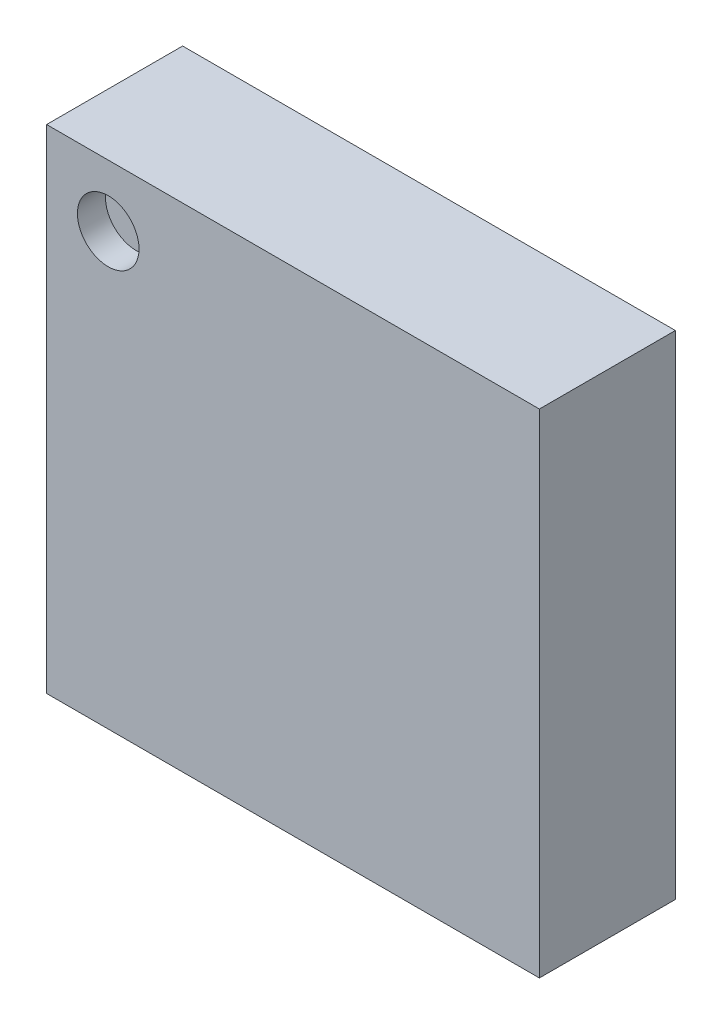
ISO-10303-21;
HEADER;
FILE_DESCRIPTION(('STEP AP214'),'2;1');
FILE_NAME('part.step','',(''),(''),'','','');
FILE_SCHEMA(('AUTOMOTIVE_DESIGN { 1 0 10303 214 1 1 1 1 }'));
ENDSEC;
DATA;
#1=APPLICATION_CONTEXT('core data for automotive mechanical design processes');
#2=APPLICATION_PROTOCOL_DEFINITION('international standard','automotive_design',2000,#1);
#3=PRODUCT_CONTEXT('',#1,'mechanical');
#4=PRODUCT('Part','Part','',(#3));
#5=PRODUCT_RELATED_PRODUCT_CATEGORY('part','',(#4));
#6=PRODUCT_DEFINITION_FORMATION('','',#4);
#7=PRODUCT_DEFINITION_CONTEXT('part definition',#1,'design');
#8=PRODUCT_DEFINITION('design','',#6,#7);
#9=PRODUCT_DEFINITION_SHAPE('','',#8);
#10=(LENGTH_UNIT() NAMED_UNIT(*) SI_UNIT(.MILLI.,.METRE.));
#11=(NAMED_UNIT(*) PLANE_ANGLE_UNIT() SI_UNIT($,.RADIAN.));
#12=(NAMED_UNIT(*) SI_UNIT($,.STERADIAN.) SOLID_ANGLE_UNIT());
#13=UNCERTAINTY_MEASURE_WITH_UNIT(LENGTH_MEASURE(1.E-05),#10,'distance_accuracy_value','');
#14=(GEOMETRIC_REPRESENTATION_CONTEXT(3) GLOBAL_UNCERTAINTY_ASSIGNED_CONTEXT((#13)) GLOBAL_UNIT_ASSIGNED_CONTEXT((#10,
#11,#12)) REPRESENTATION_CONTEXT('',''));
#15=CARTESIAN_POINT('',(0.,0.,0.));
#16=DIRECTION('',(0.,0.,1.));
#17=DIRECTION('',(1.,0.,0.));
#18=AXIS2_PLACEMENT_3D('',#15,#16,#17);
#19=CARTESIAN_POINT('',(-0.308,-0.308,0.18));
#20=DIRECTION('',(1.,0.,0.));
#21=DIRECTION('',(0.,0.,1.));
#22=AXIS2_PLACEMENT_3D('',#19,#20,#21);
#23=PLANE('',#22);
#24=DIRECTION('',(0.,1.,0.));
#25=VECTOR('',#24,1.);
#26=CARTESIAN_POINT('',(-0.308,-0.308,0.35));
#27=LINE('',#26,#25);
#28=CARTESIAN_POINT('',(-0.308,-0.308,0.35));
#29=VERTEX_POINT('',#28);
#30=CARTESIAN_POINT('',(-0.308,0.308,0.35));
#31=VERTEX_POINT('',#30);
#32=EDGE_CURVE('E11',#29,#31,#27,.T.);
#33=ORIENTED_EDGE('',*,*,#32,.T.);
#34=DIRECTION('',(0.,0.,1.));
#35=VECTOR('',#34,1.);
#36=CARTESIAN_POINT('',(-0.308,0.308,0.18));
#37=LINE('',#36,#35);
#38=CARTESIAN_POINT('',(-0.308,0.308,0.18));
#39=VERTEX_POINT('',#38);
#40=EDGE_CURVE('E24',#39,#31,#37,.T.);
#41=ORIENTED_EDGE('',*,*,#40,.F.);
#42=DIRECTION('',(0.,1.,0.));
#43=VECTOR('',#42,1.);
#44=CARTESIAN_POINT('',(-0.308,-0.308,0.18));
#45=LINE('',#44,#43);
#46=CARTESIAN_POINT('',(-0.308,-0.308,0.18));
#47=VERTEX_POINT('',#46);
#48=EDGE_CURVE('E95',#47,#39,#45,.T.);
#49=ORIENTED_EDGE('',*,*,#48,.F.);
#50=DIRECTION('',(0.,0.,1.));
#51=VECTOR('',#50,1.);
#52=CARTESIAN_POINT('',(-0.308,-0.308,0.18));
#53=LINE('',#52,#51);
#54=EDGE_CURVE('E36',#47,#29,#53,.T.);
#55=ORIENTED_EDGE('',*,*,#54,.T.);
#56=EDGE_LOOP('',(#33,#41,#49,#55));
#57=FACE_BOUND('',#56,.T.);
#58=ADVANCED_FACE('F17',(#57),#23,.F.);
#59=CARTESIAN_POINT('',(-0.308,-0.308,0.18));
#60=DIRECTION('',(0.,1.,0.));
#61=DIRECTION('',(0.,0.,1.));
#62=AXIS2_PLACEMENT_3D('',#59,#60,#61);
#63=PLANE('',#62);
#64=DIRECTION('',(0.,0.,1.));
#65=VECTOR('',#64,1.);
#66=CARTESIAN_POINT('',(0.308,-0.308,0.18));
#67=LINE('',#66,#65);
#68=CARTESIAN_POINT('',(0.308,-0.308,0.18));
#69=VERTEX_POINT('',#68);
#70=CARTESIAN_POINT('',(0.308,-0.308,0.35));
#71=VERTEX_POINT('',#70);
#72=EDGE_CURVE('E91',#69,#71,#67,.T.);
#73=ORIENTED_EDGE('',*,*,#72,.T.);
#74=DIRECTION('',(1.,0.,0.));
#75=VECTOR('',#74,1.);
#76=CARTESIAN_POINT('',(-0.308,-0.308,0.35));
#77=LINE('',#76,#75);
#78=EDGE_CURVE('E89',#29,#71,#77,.T.);
#79=ORIENTED_EDGE('',*,*,#78,.F.);
#80=ORIENTED_EDGE('',*,*,#54,.F.);
#81=DIRECTION('',(1.,0.,0.));
#82=VECTOR('',#81,1.);
#83=CARTESIAN_POINT('',(-0.308,-0.308,0.18));
#84=LINE('',#83,#82);
#85=EDGE_CURVE('E87',#47,#69,#84,.T.);
#86=ORIENTED_EDGE('',*,*,#85,.T.);
#87=EDGE_LOOP('',(#73,#79,#80,#86));
#88=FACE_BOUND('',#87,.T.);
#89=ADVANCED_FACE('F109',(#88),#63,.F.);
#90=CARTESIAN_POINT('',(-0.308,-0.308,0.35));
#91=DIRECTION('',(0.,0.,1.));
#92=DIRECTION('',(1.,0.,0.));
#93=AXIS2_PLACEMENT_3D('',#90,#91,#92);
#94=PLANE('',#93);
#95=ORIENTED_EDGE('',*,*,#32,.F.);
#96=ORIENTED_EDGE('',*,*,#78,.T.);
#97=DIRECTION('',(0.,1.,0.));
#98=VECTOR('',#97,1.);
#99=CARTESIAN_POINT('',(0.308,-0.308,0.35));
#100=LINE('',#99,#98);
#101=CARTESIAN_POINT('',(0.308,0.308,0.35));
#102=VERTEX_POINT('',#101);
#103=EDGE_CURVE('E85',#71,#102,#100,.T.);
#104=ORIENTED_EDGE('',*,*,#103,.T.);
#105=DIRECTION('',(1.,0.,0.));
#106=VECTOR('',#105,1.);
#107=CARTESIAN_POINT('',(-0.308,0.308,0.35));
#108=LINE('',#107,#106);
#109=EDGE_CURVE('E83',#31,#102,#108,.T.);
#110=ORIENTED_EDGE('',*,*,#109,.F.);
#111=EDGE_LOOP('',(#95,#96,#104,#110));
#112=FACE_BOUND('',#111,.T.);
#113=CARTESIAN_POINT('',(-0.231,0.231,0.35));
#114=DIRECTION('',(0.,0.,1.));
#115=DIRECTION('',(1.,0.,0.));
#116=AXIS2_PLACEMENT_3D('',#113,#114,#115);
#117=CIRCLE('',#116,0.0385);
#118=CARTESIAN_POINT('',(-0.1925,0.231,0.35));
#119=VERTEX_POINT('',#118);
#120=EDGE_CURVE('E68',#119,#119,#117,.T.);
#121=ORIENTED_EDGE('',*,*,#120,.F.);
#122=EDGE_LOOP('',(#121));
#123=FACE_BOUND('',#122,.T.);
#124=ADVANCED_FACE('F111',(#112,#123),#94,.T.);
#125=CARTESIAN_POINT('',(-0.308,0.308,0.18));
#126=DIRECTION('',(0.,1.,0.));
#127=DIRECTION('',(0.,0.,1.));
#128=AXIS2_PLACEMENT_3D('',#125,#126,#127);
#129=PLANE('',#128);
#130=DIRECTION('',(1.,0.,0.));
#131=VECTOR('',#130,1.);
#132=CARTESIAN_POINT('',(-0.308,0.308,0.18));
#133=LINE('',#132,#131);
#134=CARTESIAN_POINT('',(0.308,0.308,0.18));
#135=VERTEX_POINT('',#134);
#136=EDGE_CURVE('E80',#39,#135,#133,.T.);
#137=ORIENTED_EDGE('',*,*,#136,.F.);
#138=ORIENTED_EDGE('',*,*,#40,.T.);
#139=ORIENTED_EDGE('',*,*,#109,.T.);
#140=DIRECTION('',(0.,0.,1.));
#141=VECTOR('',#140,1.);
#142=CARTESIAN_POINT('',(0.308,0.308,0.18));
#143=LINE('',#142,#141);
#144=EDGE_CURVE('E75',#135,#102,#143,.T.);
#145=ORIENTED_EDGE('',*,*,#144,.F.);
#146=EDGE_LOOP('',(#137,#138,#139,#145));
#147=FACE_BOUND('',#146,.T.);
#148=ADVANCED_FACE('F102',(#147),#129,.T.);
#149=CARTESIAN_POINT('',(-0.308,-0.308,0.18));
#150=DIRECTION('',(0.,0.,1.));
#151=DIRECTION('',(1.,0.,0.));
#152=AXIS2_PLACEMENT_3D('',#149,#150,#151);
#153=PLANE('',#152);
#154=ORIENTED_EDGE('',*,*,#136,.T.);
#155=DIRECTION('',(0.,1.,0.));
#156=VECTOR('',#155,1.);
#157=CARTESIAN_POINT('',(0.308,-0.308,0.18));
#158=LINE('',#157,#156);
#159=EDGE_CURVE('E72',#69,#135,#158,.T.);
#160=ORIENTED_EDGE('',*,*,#159,.F.);
#161=ORIENTED_EDGE('',*,*,#85,.F.);
#162=ORIENTED_EDGE('',*,*,#48,.T.);
#163=EDGE_LOOP('',(#154,#160,#161,#162));
#164=FACE_BOUND('',#163,.T.);
#165=ADVANCED_FACE('F98',(#164),#153,.F.);
#166=CARTESIAN_POINT('',(0.308,-0.308,0.18));
#167=DIRECTION('',(1.,0.,0.));
#168=DIRECTION('',(0.,0.,1.));
#169=AXIS2_PLACEMENT_3D('',#166,#167,#168);
#170=PLANE('',#169);
#171=ORIENTED_EDGE('',*,*,#72,.F.);
#172=ORIENTED_EDGE('',*,*,#159,.T.);
#173=ORIENTED_EDGE('',*,*,#144,.T.);
#174=ORIENTED_EDGE('',*,*,#103,.F.);
#175=EDGE_LOOP('',(#171,#172,#173,#174));
#176=FACE_BOUND('',#175,.T.);
#177=ADVANCED_FACE('F106',(#176),#170,.T.);
#178=CARTESIAN_POINT('',(-0.231,0.231,0.315));
#179=DIRECTION('',(0.,0.,1.));
#180=DIRECTION('',(1.,0.,0.));
#181=AXIS2_PLACEMENT_3D('',#178,#179,#180);
#182=CYLINDRICAL_SURFACE('',#181,0.0385);
#183=CARTESIAN_POINT('',(-0.231,0.231,0.315));
#184=DIRECTION('',(0.,0.,1.));
#185=DIRECTION('',(1.,0.,0.));
#186=AXIS2_PLACEMENT_3D('',#183,#184,#185);
#187=CIRCLE('',#186,0.0385);
#188=CARTESIAN_POINT('',(-0.1925,0.231,0.315));
#189=VERTEX_POINT('',#188);
#190=EDGE_CURVE('E66',#189,#189,#187,.T.);
#191=ORIENTED_EDGE('',*,*,#190,.F.);
#192=DIRECTION('',(0.,0.,1.));
#193=VECTOR('',#192,1.);
#194=CARTESIAN_POINT('',(-0.1925,0.231,0.315));
#195=LINE('',#194,#193);
#196=EDGE_CURVE('E63',#189,#119,#195,.T.);
#197=ORIENTED_EDGE('',*,*,#196,.T.);
#198=ORIENTED_EDGE('',*,*,#120,.T.);
#199=ORIENTED_EDGE('',*,*,#196,.F.);
#200=EDGE_LOOP('',(#191,#197,#198,#199));
#201=FACE_BOUND('',#200,.T.);
#202=ADVANCED_FACE('F65',(#201),#182,.F.);
#203=CARTESIAN_POINT('',(-0.231,0.231,0.315));
#204=DIRECTION('',(0.,0.,1.));
#205=DIRECTION('',(1.,0.,0.));
#206=AXIS2_PLACEMENT_3D('',#203,#204,#205);
#207=PLANE('',#206);
#208=ORIENTED_EDGE('',*,*,#190,.T.);
#209=EDGE_LOOP('',(#208));
#210=FACE_BOUND('',#209,.T.);
#211=ADVANCED_FACE('F71',(#210),#207,.T.);
#212=CLOSED_SHELL('',(#58,#89,#124,#148,#165,#177,#202,#211));
#213=MANIFOLD_SOLID_BREP('B1',#212);
#214=ADVANCED_BREP_SHAPE_REPRESENTATION('',(#18,#213),#14);
#215=SHAPE_DEFINITION_REPRESENTATION(#9,#214);
ENDSEC;
END-ISO-10303-21;
